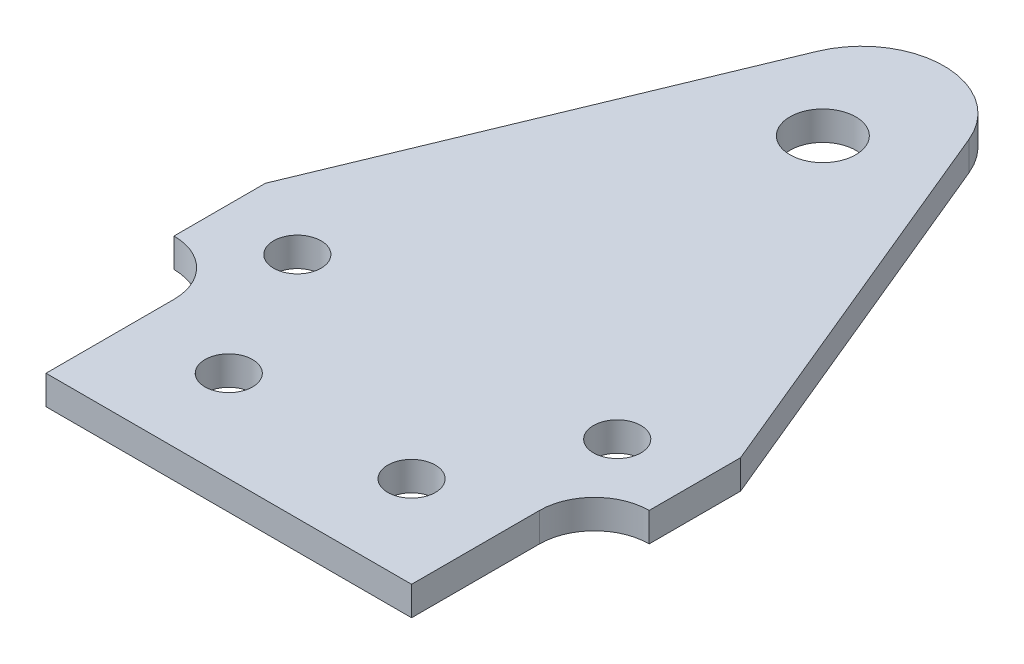
ISO-10303-21;
HEADER;
FILE_DESCRIPTION(('STEP AP214'),'2;1');
FILE_NAME('part.step','',(''),(''),'','','');
FILE_SCHEMA(('AUTOMOTIVE_DESIGN { 1 0 10303 214 1 1 1 1 }'));
ENDSEC;
DATA;
#1=APPLICATION_CONTEXT('core data for automotive mechanical design processes');
#2=APPLICATION_PROTOCOL_DEFINITION('international standard','automotive_design',2000,#1);
#3=PRODUCT_CONTEXT('',#1,'mechanical');
#4=PRODUCT('Part','Part','',(#3));
#5=PRODUCT_RELATED_PRODUCT_CATEGORY('part','',(#4));
#6=PRODUCT_DEFINITION_FORMATION('','',#4);
#7=PRODUCT_DEFINITION_CONTEXT('part definition',#1,'design');
#8=PRODUCT_DEFINITION('design','',#6,#7);
#9=PRODUCT_DEFINITION_SHAPE('','',#8);
#10=(LENGTH_UNIT() NAMED_UNIT(*) SI_UNIT(.MILLI.,.METRE.));
#11=(NAMED_UNIT(*) PLANE_ANGLE_UNIT() SI_UNIT($,.RADIAN.));
#12=(NAMED_UNIT(*) SI_UNIT($,.STERADIAN.) SOLID_ANGLE_UNIT());
#13=UNCERTAINTY_MEASURE_WITH_UNIT(LENGTH_MEASURE(1.E-05),#10,'distance_accuracy_value','');
#14=(GEOMETRIC_REPRESENTATION_CONTEXT(3) GLOBAL_UNCERTAINTY_ASSIGNED_CONTEXT((#13)) GLOBAL_UNIT_ASSIGNED_CONTEXT((#10,
#11,#12)) REPRESENTATION_CONTEXT('',''));
#15=CARTESIAN_POINT('',(0.,0.,0.));
#16=DIRECTION('',(0.,0.,1.));
#17=DIRECTION('',(1.,0.,0.));
#18=AXIS2_PLACEMENT_3D('',#15,#16,#17);
#19=CARTESIAN_POINT('',(26.0000346221252,3.175,-13.9999999999998));
#20=DIRECTION('',(0.,-1.,0.));
#21=DIRECTION('',(0.,0.,-1.));
#22=AXIS2_PLACEMENT_3D('',#19,#20,#21);
#23=PLANE('',#22);
#24=CARTESIAN_POINT('',(0.,3.175,-65.));
#25=DIRECTION('',(0.,1.,0.));
#26=DIRECTION('',(0.,0.,1.));
#27=AXIS2_PLACEMENT_3D('',#24,#25,#26);
#28=CIRCLE('',#27,3.6);
#29=CARTESIAN_POINT('',(0.,3.175,-61.4));
#30=VERTEX_POINT('',#29);
#31=EDGE_CURVE('E223',#30,#30,#28,.T.);
#32=ORIENTED_EDGE('',*,*,#31,.F.);
#33=EDGE_LOOP('',(#32));
#34=FACE_BOUND('',#33,.T.);
#35=CARTESIAN_POINT('',(17.5,3.175,-24.9999999999999));
#36=DIRECTION('',(0.,1.,0.));
#37=DIRECTION('',(0.,0.,-1.));
#38=AXIS2_PLACEMENT_3D('',#35,#36,#37);
#39=CIRCLE('',#38,2.6);
#40=CARTESIAN_POINT('',(17.5,3.175,-27.5999999999999));
#41=VERTEX_POINT('',#40);
#42=EDGE_CURVE('E211',#41,#41,#39,.T.);
#43=ORIENTED_EDGE('',*,*,#42,.F.);
#44=EDGE_LOOP('',(#43));
#45=FACE_BOUND('',#44,.T.);
#46=CARTESIAN_POINT('',(26.0000346221252,3.175,-13.9999999999998));
#47=DIRECTION('',(0.,-1.,0.));
#48=DIRECTION('',(0.,0.,-1.));
#49=AXIS2_PLACEMENT_3D('',#46,#47,#48);
#50=CIRCLE('',#49,6.00003462212519);
#51=CARTESIAN_POINT('',(20.,3.175,-13.9999999999999));
#52=VERTEX_POINT('',#51);
#53=CARTESIAN_POINT('',(26.,3.175,-20.0000346220251));
#54=VERTEX_POINT('',#53);
#55=EDGE_CURVE('E160',#52,#54,#50,.T.);
#56=ORIENTED_EDGE('',*,*,#55,.T.);
#57=DIRECTION('',(0.,0.,-1.));
#58=VECTOR('',#57,1.);
#59=CARTESIAN_POINT('',(26.,3.175,-30.0000346220251));
#60=LINE('',#59,#58);
#61=CARTESIAN_POINT('',(26.,3.175,-30.0000346220251));
#62=VERTEX_POINT('',#61);
#63=EDGE_CURVE('E98',#54,#62,#60,.T.);
#64=ORIENTED_EDGE('',*,*,#63,.T.);
#65=DIRECTION('',(-0.382683432365084,0.,-0.923879532511289));
#66=VECTOR('',#65,1.);
#67=CARTESIAN_POINT('',(8.3149157926016,3.175,-72.6956047672374));
#68=LINE('',#67,#66);
#69=CARTESIAN_POINT('',(8.3149157926016,3.175,-72.6956047672374));
#70=VERTEX_POINT('',#69);
#71=EDGE_CURVE('E181',#62,#70,#68,.T.);
#72=ORIENTED_EDGE('',*,*,#71,.T.);
#73=CARTESIAN_POINT('',(0.,3.175,-69.2514538759516));
#74=DIRECTION('',(0.,1.,0.));
#75=DIRECTION('',(0.,0.,-1.));
#76=AXIS2_PLACEMENT_3D('',#73,#74,#75);
#77=CIRCLE('',#76,9.);
#78=CARTESIAN_POINT('',(-8.3149157926016,3.175,-72.6956047672374));
#79=VERTEX_POINT('',#78);
#80=EDGE_CURVE('E200',#70,#79,#77,.T.);
#81=ORIENTED_EDGE('',*,*,#80,.T.);
#82=DIRECTION('',(-0.382683432365084,0.,0.923879532511289));
#83=VECTOR('',#82,1.);
#84=CARTESIAN_POINT('',(-8.3149157926016,3.175,-72.6956047672374));
#85=LINE('',#84,#83);
#86=CARTESIAN_POINT('',(-26.,3.175,-30.0000346220251));
#87=VERTEX_POINT('',#86);
#88=EDGE_CURVE('E197',#79,#87,#85,.T.);
#89=ORIENTED_EDGE('',*,*,#88,.T.);
#90=DIRECTION('',(0.,0.,1.));
#91=VECTOR('',#90,1.);
#92=CARTESIAN_POINT('',(-26.,3.175,-30.0000346220251));
#93=LINE('',#92,#91);
#94=CARTESIAN_POINT('',(-26.,3.175,-20.0000346220251));
#95=VERTEX_POINT('',#94);
#96=EDGE_CURVE('E199',#87,#95,#93,.T.);
#97=ORIENTED_EDGE('',*,*,#96,.T.);
#98=CARTESIAN_POINT('',(-26.0000346221252,3.175,-13.9999999999998));
#99=DIRECTION('',(0.,-1.,0.));
#100=DIRECTION('',(0.,0.,1.));
#101=AXIS2_PLACEMENT_3D('',#98,#99,#100);
#102=CIRCLE('',#101,6.00003462212518);
#103=CARTESIAN_POINT('',(-20.,3.175,-13.9999999999999));
#104=VERTEX_POINT('',#103);
#105=EDGE_CURVE('E123',#95,#104,#102,.T.);
#106=ORIENTED_EDGE('',*,*,#105,.T.);
#107=DIRECTION('',(0.,0.,1.));
#108=VECTOR('',#107,1.);
#109=CARTESIAN_POINT('',(-19.9999999999999,3.175,0.));
#110=LINE('',#109,#108);
#111=CARTESIAN_POINT('',(-19.9999999999999,3.175,0.));
#112=VERTEX_POINT('',#111);
#113=EDGE_CURVE('E117',#104,#112,#110,.T.);
#114=ORIENTED_EDGE('',*,*,#113,.T.);
#115=DIRECTION('',(1.,0.,0.));
#116=VECTOR('',#115,1.);
#117=CARTESIAN_POINT('',(19.9999999999999,3.175,0.));
#118=LINE('',#117,#116);
#119=CARTESIAN_POINT('',(19.9999999999999,3.175,0.));
#120=VERTEX_POINT('',#119);
#121=EDGE_CURVE('E121',#112,#120,#118,.T.);
#122=ORIENTED_EDGE('',*,*,#121,.T.);
#123=DIRECTION('',(0.,0.,-1.));
#124=VECTOR('',#123,1.);
#125=CARTESIAN_POINT('',(19.9999999999999,3.175,0.));
#126=LINE('',#125,#124);
#127=EDGE_CURVE('E49',#120,#52,#126,.T.);
#128=ORIENTED_EDGE('',*,*,#127,.T.);
#129=EDGE_LOOP('',(#56,#64,#72,#81,#89,#97,#106,#114,#122,#128));
#130=FACE_BOUND('',#129,.T.);
#131=CARTESIAN_POINT('',(10.,3.175,-10.));
#132=DIRECTION('',(0.,1.,0.));
#133=DIRECTION('',(0.,0.,-1.));
#134=AXIS2_PLACEMENT_3D('',#131,#132,#133);
#135=CIRCLE('',#134,2.59999999999999);
#136=CARTESIAN_POINT('',(10.,3.175,-12.6));
#137=VERTEX_POINT('',#136);
#138=EDGE_CURVE('E145',#137,#137,#135,.T.);
#139=ORIENTED_EDGE('',*,*,#138,.F.);
#140=EDGE_LOOP('',(#139));
#141=FACE_BOUND('',#140,.T.);
#142=CARTESIAN_POINT('',(-17.5,3.175,-24.9999999999999));
#143=DIRECTION('',(0.,1.,0.));
#144=DIRECTION('',(0.,0.,1.));
#145=AXIS2_PLACEMENT_3D('',#142,#143,#144);
#146=CIRCLE('',#145,2.59999999999999);
#147=CARTESIAN_POINT('',(-17.5,3.175,-22.3999999999999));
#148=VERTEX_POINT('',#147);
#149=EDGE_CURVE('E217',#148,#148,#146,.T.);
#150=ORIENTED_EDGE('',*,*,#149,.F.);
#151=EDGE_LOOP('',(#150));
#152=FACE_BOUND('',#151,.T.);
#153=CARTESIAN_POINT('',(-10.,3.175,-10.));
#154=DIRECTION('',(0.,1.,0.));
#155=DIRECTION('',(0.,0.,1.));
#156=AXIS2_PLACEMENT_3D('',#153,#154,#155);
#157=CIRCLE('',#156,2.59999999999999);
#158=CARTESIAN_POINT('',(-10.,3.175,-7.4));
#159=VERTEX_POINT('',#158);
#160=EDGE_CURVE('E229',#159,#159,#157,.T.);
#161=ORIENTED_EDGE('',*,*,#160,.F.);
#162=EDGE_LOOP('',(#161));
#163=FACE_BOUND('',#162,.T.);
#164=ADVANCED_FACE('F32',(#34,#45,#130,#141,#152,#163),#23,.F.);
#165=CARTESIAN_POINT('',(26.0000346221252,0.,-13.9999999999998));
#166=DIRECTION('',(0.,-1.,0.));
#167=DIRECTION('',(0.,0.,-1.));
#168=AXIS2_PLACEMENT_3D('',#165,#166,#167);
#169=PLANE('',#168);
#170=CARTESIAN_POINT('',(0.,0.,-65.));
#171=DIRECTION('',(0.,1.,0.));
#172=DIRECTION('',(0.,0.,1.));
#173=AXIS2_PLACEMENT_3D('',#170,#171,#172);
#174=CIRCLE('',#173,3.6);
#175=CARTESIAN_POINT('',(0.,0.,-61.4));
#176=VERTEX_POINT('',#175);
#177=EDGE_CURVE('E226',#176,#176,#174,.T.);
#178=ORIENTED_EDGE('',*,*,#177,.T.);
#179=EDGE_LOOP('',(#178));
#180=FACE_BOUND('',#179,.T.);
#181=CARTESIAN_POINT('',(17.5,0.,-24.9999999999999));
#182=DIRECTION('',(0.,1.,0.));
#183=DIRECTION('',(0.,0.,-1.));
#184=AXIS2_PLACEMENT_3D('',#181,#182,#183);
#185=CIRCLE('',#184,2.6);
#186=CARTESIAN_POINT('',(17.5,0.,-27.5999999999999));
#187=VERTEX_POINT('',#186);
#188=EDGE_CURVE('E214',#187,#187,#185,.T.);
#189=ORIENTED_EDGE('',*,*,#188,.T.);
#190=EDGE_LOOP('',(#189));
#191=FACE_BOUND('',#190,.T.);
#192=CARTESIAN_POINT('',(26.0000346221252,0.,-13.9999999999998));
#193=DIRECTION('',(0.,-1.,0.));
#194=DIRECTION('',(0.,0.,-1.));
#195=AXIS2_PLACEMENT_3D('',#192,#193,#194);
#196=CIRCLE('',#195,6.00003462212519);
#197=CARTESIAN_POINT('',(20.,0.,-13.9999999999999));
#198=VERTEX_POINT('',#197);
#199=CARTESIAN_POINT('',(26.,0.,-20.0000346220251));
#200=VERTEX_POINT('',#199);
#201=EDGE_CURVE('E141',#198,#200,#196,.T.);
#202=ORIENTED_EDGE('',*,*,#201,.F.);
#203=DIRECTION('',(0.,0.,-1.));
#204=VECTOR('',#203,1.);
#205=CARTESIAN_POINT('',(19.9999999999999,0.,0.));
#206=LINE('',#205,#204);
#207=CARTESIAN_POINT('',(19.9999999999999,0.,0.));
#208=VERTEX_POINT('',#207);
#209=EDGE_CURVE('E90',#208,#198,#206,.T.);
#210=ORIENTED_EDGE('',*,*,#209,.F.);
#211=DIRECTION('',(1.,0.,0.));
#212=VECTOR('',#211,1.);
#213=CARTESIAN_POINT('',(19.9999999999999,0.,0.));
#214=LINE('',#213,#212);
#215=CARTESIAN_POINT('',(-19.9999999999999,0.,0.));
#216=VERTEX_POINT('',#215);
#217=EDGE_CURVE('E84',#216,#208,#214,.T.);
#218=ORIENTED_EDGE('',*,*,#217,.F.);
#219=DIRECTION('',(0.,0.,1.));
#220=VECTOR('',#219,1.);
#221=CARTESIAN_POINT('',(-19.9999999999999,0.,0.));
#222=LINE('',#221,#220);
#223=CARTESIAN_POINT('',(-20.,0.,-13.9999999999999));
#224=VERTEX_POINT('',#223);
#225=EDGE_CURVE('E131',#224,#216,#222,.T.);
#226=ORIENTED_EDGE('',*,*,#225,.F.);
#227=CARTESIAN_POINT('',(-26.0000346221252,0.,-13.9999999999998));
#228=DIRECTION('',(0.,-1.,0.));
#229=DIRECTION('',(0.,0.,1.));
#230=AXIS2_PLACEMENT_3D('',#227,#228,#229);
#231=CIRCLE('',#230,6.00003462212518);
#232=CARTESIAN_POINT('',(-26.,0.,-20.0000346220251));
#233=VERTEX_POINT('',#232);
#234=EDGE_CURVE('E155',#233,#224,#231,.T.);
#235=ORIENTED_EDGE('',*,*,#234,.F.);
#236=DIRECTION('',(0.,0.,1.));
#237=VECTOR('',#236,1.);
#238=CARTESIAN_POINT('',(-26.,0.,-30.0000346220251));
#239=LINE('',#238,#237);
#240=CARTESIAN_POINT('',(-26.,0.,-30.0000346220251));
#241=VERTEX_POINT('',#240);
#242=EDGE_CURVE('E153',#241,#233,#239,.T.);
#243=ORIENTED_EDGE('',*,*,#242,.F.);
#244=DIRECTION('',(-0.382683432365084,0.,0.923879532511289));
#245=VECTOR('',#244,1.);
#246=CARTESIAN_POINT('',(-8.3149157926016,0.,-72.6956047672374));
#247=LINE('',#246,#245);
#248=CARTESIAN_POINT('',(-8.3149157926016,0.,-72.6956047672374));
#249=VERTEX_POINT('',#248);
#250=EDGE_CURVE('E151',#249,#241,#247,.T.);
#251=ORIENTED_EDGE('',*,*,#250,.F.);
#252=CARTESIAN_POINT('',(0.,0.,-69.2514538759516));
#253=DIRECTION('',(0.,1.,0.));
#254=DIRECTION('',(0.,0.,-1.));
#255=AXIS2_PLACEMENT_3D('',#252,#253,#254);
#256=CIRCLE('',#255,9.);
#257=CARTESIAN_POINT('',(8.3149157926016,0.,-72.6956047672374));
#258=VERTEX_POINT('',#257);
#259=EDGE_CURVE('E149',#258,#249,#256,.T.);
#260=ORIENTED_EDGE('',*,*,#259,.F.);
#261=DIRECTION('',(-0.382683432365084,0.,-0.923879532511289));
#262=VECTOR('',#261,1.);
#263=CARTESIAN_POINT('',(8.3149157926016,0.,-72.6956047672374));
#264=LINE('',#263,#262);
#265=CARTESIAN_POINT('',(26.,0.,-30.0000346220251));
#266=VERTEX_POINT('',#265);
#267=EDGE_CURVE('E147',#266,#258,#264,.T.);
#268=ORIENTED_EDGE('',*,*,#267,.F.);
#269=DIRECTION('',(0.,0.,-1.));
#270=VECTOR('',#269,1.);
#271=CARTESIAN_POINT('',(26.,0.,-30.0000346220251));
#272=LINE('',#271,#270);
#273=EDGE_CURVE('E144',#200,#266,#272,.T.);
#274=ORIENTED_EDGE('',*,*,#273,.F.);
#275=EDGE_LOOP('',(#202,#210,#218,#226,#235,#243,#251,#260,#268,#274));
#276=FACE_BOUND('',#275,.T.);
#277=CARTESIAN_POINT('',(10.,0.,-10.));
#278=DIRECTION('',(0.,1.,0.));
#279=DIRECTION('',(0.,0.,-1.));
#280=AXIS2_PLACEMENT_3D('',#277,#278,#279);
#281=CIRCLE('',#280,2.59999999999999);
#282=CARTESIAN_POINT('',(10.,0.,-12.6));
#283=VERTEX_POINT('',#282);
#284=EDGE_CURVE('E208',#283,#283,#281,.T.);
#285=ORIENTED_EDGE('',*,*,#284,.T.);
#286=EDGE_LOOP('',(#285));
#287=FACE_BOUND('',#286,.T.);
#288=CARTESIAN_POINT('',(-17.5,0.,-24.9999999999999));
#289=DIRECTION('',(0.,1.,0.));
#290=DIRECTION('',(0.,0.,1.));
#291=AXIS2_PLACEMENT_3D('',#288,#289,#290);
#292=CIRCLE('',#291,2.59999999999999);
#293=CARTESIAN_POINT('',(-17.5,0.,-22.3999999999999));
#294=VERTEX_POINT('',#293);
#295=EDGE_CURVE('E220',#294,#294,#292,.T.);
#296=ORIENTED_EDGE('',*,*,#295,.T.);
#297=EDGE_LOOP('',(#296));
#298=FACE_BOUND('',#297,.T.);
#299=CARTESIAN_POINT('',(-10.,0.,-10.));
#300=DIRECTION('',(0.,1.,0.));
#301=DIRECTION('',(0.,0.,1.));
#302=AXIS2_PLACEMENT_3D('',#299,#300,#301);
#303=CIRCLE('',#302,2.59999999999999);
#304=CARTESIAN_POINT('',(-10.,0.,-7.4));
#305=VERTEX_POINT('',#304);
#306=EDGE_CURVE('E232',#305,#305,#303,.T.);
#307=ORIENTED_EDGE('',*,*,#306,.T.);
#308=EDGE_LOOP('',(#307));
#309=FACE_BOUND('',#308,.T.);
#310=ADVANCED_FACE('F185',(#180,#191,#276,#287,#298,#309),#169,.T.);
#311=CARTESIAN_POINT('',(26.0000346221252,3.175,-13.9999999999998));
#312=DIRECTION('',(0.,-1.,0.));
#313=DIRECTION('',(0.,0.,-1.));
#314=AXIS2_PLACEMENT_3D('',#311,#312,#313);
#315=CYLINDRICAL_SURFACE('',#314,6.00003462212519);
#316=ORIENTED_EDGE('',*,*,#201,.T.);
#317=DIRECTION('',(0.,-1.,0.));
#318=VECTOR('',#317,1.);
#319=CARTESIAN_POINT('',(26.,3.175,-20.0000346220251));
#320=LINE('',#319,#318);
#321=EDGE_CURVE('E11',#54,#200,#320,.T.);
#322=ORIENTED_EDGE('',*,*,#321,.F.);
#323=ORIENTED_EDGE('',*,*,#55,.F.);
#324=DIRECTION('',(0.,-1.,0.));
#325=VECTOR('',#324,1.);
#326=CARTESIAN_POINT('',(20.,3.175,-13.9999999999999));
#327=LINE('',#326,#325);
#328=EDGE_CURVE('E137',#52,#198,#327,.T.);
#329=ORIENTED_EDGE('',*,*,#328,.T.);
#330=EDGE_LOOP('',(#316,#322,#323,#329));
#331=FACE_BOUND('',#330,.T.);
#332=ADVANCED_FACE('F34',(#331),#315,.F.);
#333=CARTESIAN_POINT('',(26.,3.175,-30.0000346220251));
#334=DIRECTION('',(-1.,0.,0.));
#335=DIRECTION('',(0.,0.,1.));
#336=AXIS2_PLACEMENT_3D('',#333,#334,#335);
#337=PLANE('',#336);
#338=ORIENTED_EDGE('',*,*,#273,.T.);
#339=DIRECTION('',(0.,-1.,0.));
#340=VECTOR('',#339,1.);
#341=CARTESIAN_POINT('',(26.,3.175,-30.0000346220251));
#342=LINE('',#341,#340);
#343=EDGE_CURVE('E41',#62,#266,#342,.T.);
#344=ORIENTED_EDGE('',*,*,#343,.F.);
#345=ORIENTED_EDGE('',*,*,#63,.F.);
#346=ORIENTED_EDGE('',*,*,#321,.T.);
#347=EDGE_LOOP('',(#338,#344,#345,#346));
#348=FACE_BOUND('',#347,.T.);
#349=ADVANCED_FACE('F275',(#348),#337,.F.);
#350=CARTESIAN_POINT('',(8.3149157926016,3.175,-72.6956047672374));
#351=DIRECTION('',(-0.923879532511289,0.,0.382683432365084));
#352=DIRECTION('',(0.382683432365084,0.,0.923879532511289));
#353=AXIS2_PLACEMENT_3D('',#350,#351,#352);
#354=PLANE('',#353);
#355=ORIENTED_EDGE('',*,*,#267,.T.);
#356=DIRECTION('',(0.,-1.,0.));
#357=VECTOR('',#356,1.);
#358=CARTESIAN_POINT('',(8.3149157926016,3.175,-72.6956047672374));
#359=LINE('',#358,#357);
#360=EDGE_CURVE('E173',#70,#258,#359,.T.);
#361=ORIENTED_EDGE('',*,*,#360,.F.);
#362=ORIENTED_EDGE('',*,*,#71,.F.);
#363=ORIENTED_EDGE('',*,*,#343,.T.);
#364=EDGE_LOOP('',(#355,#361,#362,#363));
#365=FACE_BOUND('',#364,.T.);
#366=ADVANCED_FACE('F179',(#365),#354,.F.);
#367=CARTESIAN_POINT('',(0.,3.175,-69.2514538759516));
#368=DIRECTION('',(0.,-1.,0.));
#369=DIRECTION('',(0.,0.,-1.));
#370=AXIS2_PLACEMENT_3D('',#367,#368,#369);
#371=CYLINDRICAL_SURFACE('',#370,9.);
#372=ORIENTED_EDGE('',*,*,#259,.T.);
#373=DIRECTION('',(0.,-1.,0.));
#374=VECTOR('',#373,1.);
#375=CARTESIAN_POINT('',(-8.3149157926016,3.175,-72.6956047672374));
#376=LINE('',#375,#374);
#377=EDGE_CURVE('E170',#79,#249,#376,.T.);
#378=ORIENTED_EDGE('',*,*,#377,.F.);
#379=ORIENTED_EDGE('',*,*,#80,.F.);
#380=ORIENTED_EDGE('',*,*,#360,.T.);
#381=EDGE_LOOP('',(#372,#378,#379,#380));
#382=FACE_BOUND('',#381,.T.);
#383=ADVANCED_FACE('F191',(#382),#371,.T.);
#384=CARTESIAN_POINT('',(-8.3149157926016,3.175,-72.6956047672374));
#385=DIRECTION('',(0.923879532511289,0.,0.382683432365084));
#386=DIRECTION('',(0.382683432365084,0.,-0.923879532511289));
#387=AXIS2_PLACEMENT_3D('',#384,#385,#386);
#388=PLANE('',#387);
#389=ORIENTED_EDGE('',*,*,#250,.T.);
#390=DIRECTION('',(0.,-1.,0.));
#391=VECTOR('',#390,1.);
#392=CARTESIAN_POINT('',(-26.,3.175,-30.0000346220251));
#393=LINE('',#392,#391);
#394=EDGE_CURVE('E167',#87,#241,#393,.T.);
#395=ORIENTED_EDGE('',*,*,#394,.F.);
#396=ORIENTED_EDGE('',*,*,#88,.F.);
#397=ORIENTED_EDGE('',*,*,#377,.T.);
#398=EDGE_LOOP('',(#389,#395,#396,#397));
#399=FACE_BOUND('',#398,.T.);
#400=ADVANCED_FACE('F195',(#399),#388,.F.);
#401=CARTESIAN_POINT('',(-26.,3.175,-30.0000346220251));
#402=DIRECTION('',(1.,0.,0.));
#403=DIRECTION('',(0.,0.,-1.));
#404=AXIS2_PLACEMENT_3D('',#401,#402,#403);
#405=PLANE('',#404);
#406=ORIENTED_EDGE('',*,*,#242,.T.);
#407=DIRECTION('',(0.,-1.,0.));
#408=VECTOR('',#407,1.);
#409=CARTESIAN_POINT('',(-26.,3.175,-20.0000346220251));
#410=LINE('',#409,#408);
#411=EDGE_CURVE('E164',#95,#233,#410,.T.);
#412=ORIENTED_EDGE('',*,*,#411,.F.);
#413=ORIENTED_EDGE('',*,*,#96,.F.);
#414=ORIENTED_EDGE('',*,*,#394,.T.);
#415=EDGE_LOOP('',(#406,#412,#413,#414));
#416=FACE_BOUND('',#415,.T.);
#417=ADVANCED_FACE('F265',(#416),#405,.F.);
#418=CARTESIAN_POINT('',(-26.0000346221252,3.175,-13.9999999999998));
#419=DIRECTION('',(0.,-1.,0.));
#420=DIRECTION('',(0.,0.,-1.));
#421=AXIS2_PLACEMENT_3D('',#418,#419,#420);
#422=CYLINDRICAL_SURFACE('',#421,6.00003462212518);
#423=ORIENTED_EDGE('',*,*,#234,.T.);
#424=DIRECTION('',(0.,-1.,0.));
#425=VECTOR('',#424,1.);
#426=CARTESIAN_POINT('',(-20.,3.175,-13.9999999999999));
#427=LINE('',#426,#425);
#428=EDGE_CURVE('E132',#104,#224,#427,.T.);
#429=ORIENTED_EDGE('',*,*,#428,.F.);
#430=ORIENTED_EDGE('',*,*,#105,.F.);
#431=ORIENTED_EDGE('',*,*,#411,.T.);
#432=EDGE_LOOP('',(#423,#429,#430,#431));
#433=FACE_BOUND('',#432,.T.);
#434=ADVANCED_FACE('F262',(#433),#422,.F.);
#435=CARTESIAN_POINT('',(-19.9999999999999,3.175,0.));
#436=DIRECTION('',(1.,0.,0.));
#437=DIRECTION('',(0.,0.,-1.));
#438=AXIS2_PLACEMENT_3D('',#435,#436,#437);
#439=PLANE('',#438);
#440=ORIENTED_EDGE('',*,*,#225,.T.);
#441=DIRECTION('',(0.,-1.,0.));
#442=VECTOR('',#441,1.);
#443=CARTESIAN_POINT('',(-19.9999999999999,3.175,0.));
#444=LINE('',#443,#442);
#445=EDGE_CURVE('E128',#112,#216,#444,.T.);
#446=ORIENTED_EDGE('',*,*,#445,.F.);
#447=ORIENTED_EDGE('',*,*,#113,.F.);
#448=ORIENTED_EDGE('',*,*,#428,.T.);
#449=EDGE_LOOP('',(#440,#446,#447,#448));
#450=FACE_BOUND('',#449,.T.);
#451=ADVANCED_FACE('F129',(#450),#439,.F.);
#452=CARTESIAN_POINT('',(19.9999999999999,3.175,0.));
#453=DIRECTION('',(0.,0.,-1.));
#454=DIRECTION('',(-1.,0.,0.));
#455=AXIS2_PLACEMENT_3D('',#452,#453,#454);
#456=PLANE('',#455);
#457=ORIENTED_EDGE('',*,*,#217,.T.);
#458=DIRECTION('',(0.,-1.,0.));
#459=VECTOR('',#458,1.);
#460=CARTESIAN_POINT('',(19.9999999999999,3.175,0.));
#461=LINE('',#460,#459);
#462=EDGE_CURVE('E133',#120,#208,#461,.T.);
#463=ORIENTED_EDGE('',*,*,#462,.F.);
#464=ORIENTED_EDGE('',*,*,#121,.F.);
#465=ORIENTED_EDGE('',*,*,#445,.T.);
#466=EDGE_LOOP('',(#457,#463,#464,#465));
#467=FACE_BOUND('',#466,.T.);
#468=ADVANCED_FACE('F135',(#467),#456,.F.);
#469=CARTESIAN_POINT('',(19.9999999999999,3.175,0.));
#470=DIRECTION('',(-1.,0.,0.));
#471=DIRECTION('',(0.,0.,1.));
#472=AXIS2_PLACEMENT_3D('',#469,#470,#471);
#473=PLANE('',#472);
#474=ORIENTED_EDGE('',*,*,#209,.T.);
#475=ORIENTED_EDGE('',*,*,#328,.F.);
#476=ORIENTED_EDGE('',*,*,#127,.F.);
#477=ORIENTED_EDGE('',*,*,#462,.T.);
#478=EDGE_LOOP('',(#474,#475,#476,#477));
#479=FACE_BOUND('',#478,.T.);
#480=ADVANCED_FACE('F255',(#479),#473,.F.);
#481=CARTESIAN_POINT('',(10.,3.175,-10.));
#482=DIRECTION('',(0.,-1.,0.));
#483=DIRECTION('',(0.,0.,-1.));
#484=AXIS2_PLACEMENT_3D('',#481,#482,#483);
#485=CYLINDRICAL_SURFACE('',#484,2.59999999999999);
#486=ORIENTED_EDGE('',*,*,#138,.T.);
#487=EDGE_LOOP('',(#486));
#488=FACE_BOUND('',#487,.T.);
#489=ORIENTED_EDGE('',*,*,#284,.F.);
#490=EDGE_LOOP('',(#489));
#491=FACE_BOUND('',#490,.T.);
#492=ADVANCED_FACE('F252',(#488,#491),#485,.F.);
#493=CARTESIAN_POINT('',(17.5,3.175,-24.9999999999999));
#494=DIRECTION('',(0.,-1.,0.));
#495=DIRECTION('',(0.,0.,-1.));
#496=AXIS2_PLACEMENT_3D('',#493,#494,#495);
#497=CYLINDRICAL_SURFACE('',#496,2.6);
#498=ORIENTED_EDGE('',*,*,#42,.T.);
#499=EDGE_LOOP('',(#498));
#500=FACE_BOUND('',#499,.T.);
#501=ORIENTED_EDGE('',*,*,#188,.F.);
#502=EDGE_LOOP('',(#501));
#503=FACE_BOUND('',#502,.T.);
#504=ADVANCED_FACE('F351',(#500,#503),#497,.F.);
#505=CARTESIAN_POINT('',(-17.5,3.175,-24.9999999999999));
#506=DIRECTION('',(0.,-1.,0.));
#507=DIRECTION('',(0.,0.,-1.));
#508=AXIS2_PLACEMENT_3D('',#505,#506,#507);
#509=CYLINDRICAL_SURFACE('',#508,2.59999999999999);
#510=ORIENTED_EDGE('',*,*,#149,.T.);
#511=EDGE_LOOP('',(#510));
#512=FACE_BOUND('',#511,.T.);
#513=ORIENTED_EDGE('',*,*,#295,.F.);
#514=EDGE_LOOP('',(#513));
#515=FACE_BOUND('',#514,.T.);
#516=ADVANCED_FACE('F359',(#512,#515),#509,.F.);
#517=CARTESIAN_POINT('',(0.,3.175,-65.));
#518=DIRECTION('',(0.,-1.,0.));
#519=DIRECTION('',(0.,0.,-1.));
#520=AXIS2_PLACEMENT_3D('',#517,#518,#519);
#521=CYLINDRICAL_SURFACE('',#520,3.6);
#522=ORIENTED_EDGE('',*,*,#31,.T.);
#523=EDGE_LOOP('',(#522));
#524=FACE_BOUND('',#523,.T.);
#525=ORIENTED_EDGE('',*,*,#177,.F.);
#526=EDGE_LOOP('',(#525));
#527=FACE_BOUND('',#526,.T.);
#528=ADVANCED_FACE('F367',(#524,#527),#521,.F.);
#529=CARTESIAN_POINT('',(-10.,3.175,-10.));
#530=DIRECTION('',(0.,-1.,0.));
#531=DIRECTION('',(0.,0.,-1.));
#532=AXIS2_PLACEMENT_3D('',#529,#530,#531);
#533=CYLINDRICAL_SURFACE('',#532,2.59999999999999);
#534=ORIENTED_EDGE('',*,*,#160,.T.);
#535=EDGE_LOOP('',(#534));
#536=FACE_BOUND('',#535,.T.);
#537=ORIENTED_EDGE('',*,*,#306,.F.);
#538=EDGE_LOOP('',(#537));
#539=FACE_BOUND('',#538,.T.);
#540=ADVANCED_FACE('F238',(#536,#539),#533,.F.);
#541=CLOSED_SHELL('',(#164,#310,#332,#349,#366,#383,#400,#417,#434,#451,#468,#480,#492,#504,
#516,#528,#540));
#542=MANIFOLD_SOLID_BREP('B2',#541);
#543=ADVANCED_BREP_SHAPE_REPRESENTATION('',(#18,#542),#14);
#544=SHAPE_DEFINITION_REPRESENTATION(#9,#543);
ENDSEC;
END-ISO-10303-21;
